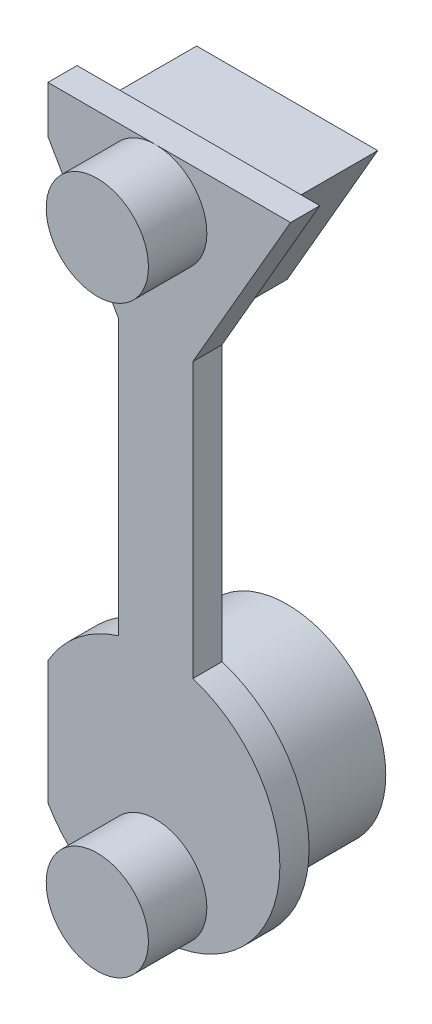
ISO-10303-21;
HEADER;
FILE_DESCRIPTION(('STEP AP214'),'2;1');
FILE_NAME('part.step','',(''),(''),'','','');
FILE_SCHEMA(('AUTOMOTIVE_DESIGN { 1 0 10303 214 1 1 1 1 }'));
ENDSEC;
DATA;
#1=APPLICATION_CONTEXT('core data for automotive mechanical design processes');
#2=APPLICATION_PROTOCOL_DEFINITION('international standard','automotive_design',2000,#1);
#3=PRODUCT_CONTEXT('',#1,'mechanical');
#4=PRODUCT('Part','Part','',(#3));
#5=PRODUCT_RELATED_PRODUCT_CATEGORY('part','',(#4));
#6=PRODUCT_DEFINITION_FORMATION('','',#4);
#7=PRODUCT_DEFINITION_CONTEXT('part definition',#1,'design');
#8=PRODUCT_DEFINITION('design','',#6,#7);
#9=PRODUCT_DEFINITION_SHAPE('','',#8);
#10=(LENGTH_UNIT() NAMED_UNIT(*) SI_UNIT(.MILLI.,.METRE.));
#11=(NAMED_UNIT(*) PLANE_ANGLE_UNIT() SI_UNIT($,.RADIAN.));
#12=(NAMED_UNIT(*) SI_UNIT($,.STERADIAN.) SOLID_ANGLE_UNIT());
#13=UNCERTAINTY_MEASURE_WITH_UNIT(LENGTH_MEASURE(1.E-05),#10,'distance_accuracy_value','');
#14=(GEOMETRIC_REPRESENTATION_CONTEXT(3) GLOBAL_UNCERTAINTY_ASSIGNED_CONTEXT((#13)) GLOBAL_UNIT_ASSIGNED_CONTEXT((#10,
#11,#12)) REPRESENTATION_CONTEXT('',''));
#15=CARTESIAN_POINT('',(0.,0.,0.));
#16=DIRECTION('',(0.,0.,1.));
#17=DIRECTION('',(1.,0.,0.));
#18=AXIS2_PLACEMENT_3D('',#15,#16,#17);
#19=CARTESIAN_POINT('',(0.126725060128514,-6.,0.8));
#20=DIRECTION('',(0.,0.,-1.));
#21=DIRECTION('',(-1.,0.,0.));
#22=AXIS2_PLACEMENT_3D('',#19,#20,#21);
#23=CYLINDRICAL_SURFACE('',#22,3.4);
#24=CARTESIAN_POINT('',(0.126725060128514,-6.,0.8));
#25=DIRECTION('',(0.,0.,1.));
#26=DIRECTION('',(1.,0.,0.));
#27=AXIS2_PLACEMENT_3D('',#24,#25,#26);
#28=CIRCLE('',#27,3.4);
#29=CARTESIAN_POINT('',(-2.82672506012852,-7.68437893217463,0.8));
#30=VERTEX_POINT('',#29);
#31=CARTESIAN_POINT('',(0.126725060128514,-9.4,0.8));
#32=VERTEX_POINT('',#31);
#33=EDGE_CURVE('E152',#30,#32,#28,.T.);
#34=ORIENTED_EDGE('',*,*,#33,.F.);
#35=DIRECTION('',(0.,0.,-1.));
#36=VECTOR('',#35,1.);
#37=CARTESIAN_POINT('',(-2.82672506012852,-7.68437893217463,0.8));
#38=LINE('',#37,#36);
#39=CARTESIAN_POINT('',(-2.82672506012852,-7.68437893217463,0.));
#40=VERTEX_POINT('',#39);
#41=EDGE_CURVE('E54',#30,#40,#38,.T.);
#42=ORIENTED_EDGE('',*,*,#41,.T.);
#43=CARTESIAN_POINT('',(0.126725060128514,-6.,0.));
#44=DIRECTION('',(0.,0.,1.));
#45=DIRECTION('',(1.,0.,0.));
#46=AXIS2_PLACEMENT_3D('',#43,#44,#45);
#47=CIRCLE('',#46,3.4);
#48=CARTESIAN_POINT('',(1.14270034624464,-2.75534374424635,0.));
#49=VERTEX_POINT('',#48);
#50=EDGE_CURVE('E162',#40,#49,#47,.T.);
#51=ORIENTED_EDGE('',*,*,#50,.T.);
#52=DIRECTION('',(0.,0.,-1.));
#53=VECTOR('',#52,1.);
#54=CARTESIAN_POINT('',(1.14270034624464,-2.75534374424635,0.8));
#55=LINE('',#54,#53);
#56=CARTESIAN_POINT('',(1.14270034624464,-2.75534374424635,0.8));
#57=VERTEX_POINT('',#56);
#58=EDGE_CURVE('E179',#57,#49,#55,.T.);
#59=ORIENTED_EDGE('',*,*,#58,.F.);
#60=EDGE_CURVE('E154',#32,#57,#28,.T.);
#61=ORIENTED_EDGE('',*,*,#60,.F.);
#62=EDGE_LOOP('',(#34,#42,#51,#59,#61));
#63=FACE_BOUND('',#62,.T.);
#64=ADVANCED_FACE('F39',(#63),#23,.T.);
#65=CARTESIAN_POINT('',(0.126725060128514,-6.,0.));
#66=DIRECTION('',(0.,0.,1.));
#67=DIRECTION('',(1.,0.,0.));
#68=AXIS2_PLACEMENT_3D('',#65,#66,#67);
#69=PLANE('',#68);
#70=ORIENTED_EDGE('',*,*,#50,.F.);
#71=DIRECTION('',(0.,1.,0.));
#72=VECTOR('',#71,1.);
#73=CARTESIAN_POINT('',(-2.82672506012852,11.8338217795605,0.));
#74=LINE('',#73,#72);
#75=CARTESIAN_POINT('',(-2.82672506012852,-4.31562106782537,0.));
#76=VERTEX_POINT('',#75);
#77=EDGE_CURVE('E257',#40,#76,#74,.T.);
#78=ORIENTED_EDGE('',*,*,#77,.T.);
#79=CARTESIAN_POINT('',(-0.88925022598761,-2.75534374424635,0.));
#80=VERTEX_POINT('',#79);
#81=EDGE_CURVE('E145',#80,#76,#47,.T.);
#82=ORIENTED_EDGE('',*,*,#81,.F.);
#83=DIRECTION('',(0.,1.,0.));
#84=VECTOR('',#83,1.);
#85=CARTESIAN_POINT('',(-0.889250225987609,4.76356839208082,0.));
#86=LINE('',#85,#84);
#87=CARTESIAN_POINT('',(-0.889250225987609,4.76356839208082,0.));
#88=VERTEX_POINT('',#87);
#89=EDGE_CURVE('E176',#80,#88,#86,.T.);
#90=ORIENTED_EDGE('',*,*,#89,.T.);
#91=DIRECTION('',(0.5,-0.866025403784438,0.));
#92=VECTOR('',#91,1.);
#93=CARTESIAN_POINT('',(0.126725060128516,3.00384757729336,0.));
#94=LINE('',#93,#92);
#95=CARTESIAN_POINT('',(-2.82672506012852,8.11937324319896,0.));
#96=VERTEX_POINT('',#95);
#97=EDGE_CURVE('E190',#96,#88,#94,.T.);
#98=ORIENTED_EDGE('',*,*,#97,.F.);
#99=CARTESIAN_POINT('',(-2.82672506012852,9.4,0.));
#100=VERTEX_POINT('',#99);
#101=EDGE_CURVE('E138',#96,#100,#74,.T.);
#102=ORIENTED_EDGE('',*,*,#101,.T.);
#103=DIRECTION('',(-1.,0.,0.));
#104=VECTOR('',#103,1.);
#105=CARTESIAN_POINT('',(-3.56609526289904,9.4,0.));
#106=LINE('',#105,#104);
#107=CARTESIAN_POINT('',(3.81954538315607,9.4,0.));
#108=VERTEX_POINT('',#107);
#109=EDGE_CURVE('E199',#108,#100,#106,.T.);
#110=ORIENTED_EDGE('',*,*,#109,.F.);
#111=DIRECTION('',(0.5,0.866025403784439,0.));
#112=VECTOR('',#111,1.);
#113=CARTESIAN_POINT('',(3.81954538315607,9.4,0.));
#114=LINE('',#113,#112);
#115=CARTESIAN_POINT('',(1.14270034624464,4.76356839208082,0.));
#116=VERTEX_POINT('',#115);
#117=EDGE_CURVE('E193',#116,#108,#114,.T.);
#118=ORIENTED_EDGE('',*,*,#117,.F.);
#119=DIRECTION('',(0.,-1.,0.));
#120=VECTOR('',#119,1.);
#121=CARTESIAN_POINT('',(1.14270034624464,4.76356839208082,0.));
#122=LINE('',#121,#120);
#123=EDGE_CURVE('E189',#116,#49,#122,.T.);
#124=ORIENTED_EDGE('',*,*,#123,.T.);
#125=EDGE_LOOP('',(#70,#78,#82,#90,#98,#102,#110,#118,#124));
#126=FACE_BOUND('',#125,.T.);
#127=CARTESIAN_POINT('',(0.126725060128514,-6.,0.));
#128=DIRECTION('',(0.,0.,1.));
#129=DIRECTION('',(1.,0.,0.));
#130=AXIS2_PLACEMENT_3D('',#127,#128,#129);
#131=CIRCLE('',#130,2.7);
#132=CARTESIAN_POINT('',(2.82672506012852,-6.,0.));
#133=VERTEX_POINT('',#132);
#134=EDGE_CURVE('E47',#133,#133,#131,.F.);
#135=ORIENTED_EDGE('',*,*,#134,.F.);
#136=EDGE_LOOP('',(#135));
#137=FACE_BOUND('',#136,.T.);
#138=DIRECTION('',(-0.5,-0.866025403784439,0.));
#139=VECTOR('',#138,1.);
#140=CARTESIAN_POINT('',(0.126725060128514,4.40384757729337,0.));
#141=LINE('',#140,#139);
#142=CARTESIAN_POINT('',(2.60710981785785,8.7,0.));
#143=VERTEX_POINT('',#142);
#144=CARTESIAN_POINT('',(0.126725060128514,4.40384757729337,0.));
#145=VERTEX_POINT('',#144);
#146=EDGE_CURVE('E219',#143,#145,#141,.T.);
#147=ORIENTED_EDGE('',*,*,#146,.F.);
#148=DIRECTION('',(1.,0.,0.));
#149=VECTOR('',#148,1.);
#150=CARTESIAN_POINT('',(2.60710981785785,8.7,0.));
#151=LINE('',#150,#149);
#152=CARTESIAN_POINT('',(-2.35365969760082,8.7,0.));
#153=VERTEX_POINT('',#152);
#154=EDGE_CURVE('E223',#153,#143,#151,.T.);
#155=ORIENTED_EDGE('',*,*,#154,.F.);
#156=DIRECTION('',(-0.5,0.866025403784439,0.));
#157=VECTOR('',#156,1.);
#158=CARTESIAN_POINT('',(-2.35365969760082,8.7,0.));
#159=LINE('',#158,#157);
#160=EDGE_CURVE('E231',#145,#153,#159,.T.);
#161=ORIENTED_EDGE('',*,*,#160,.F.);
#162=EDGE_LOOP('',(#147,#155,#161));
#163=FACE_BOUND('',#162,.T.);
#164=ADVANCED_FACE('F260',(#126,#137,#163),#69,.F.);
#165=ORIENTED_EDGE('',*,*,#81,.T.);
#166=DIRECTION('',(0.,0.,-1.));
#167=VECTOR('',#166,1.);
#168=CARTESIAN_POINT('',(-2.82672506012852,-4.31562106782537,0.8));
#169=LINE('',#168,#167);
#170=CARTESIAN_POINT('',(-2.82672506012852,-4.31562106782537,0.8));
#171=VERTEX_POINT('',#170);
#172=EDGE_CURVE('E133',#76,#171,#169,.F.);
#173=ORIENTED_EDGE('',*,*,#172,.T.);
#174=CARTESIAN_POINT('',(-0.88925022598761,-2.75534374424635,0.8));
#175=VERTEX_POINT('',#174);
#176=EDGE_CURVE('E143',#175,#171,#28,.T.);
#177=ORIENTED_EDGE('',*,*,#176,.F.);
#178=DIRECTION('',(0.,0.,-1.));
#179=VECTOR('',#178,1.);
#180=CARTESIAN_POINT('',(-0.88925022598761,-2.75534374424635,0.8));
#181=LINE('',#180,#179);
#182=EDGE_CURVE('E173',#175,#80,#181,.T.);
#183=ORIENTED_EDGE('',*,*,#182,.T.);
#184=EDGE_LOOP('',(#165,#173,#177,#183));
#185=FACE_BOUND('',#184,.T.);
#186=ADVANCED_FACE('F41',(#185),#23,.T.);
#187=CARTESIAN_POINT('',(0.126725060128514,-6.,0.8));
#188=DIRECTION('',(0.,0.,1.));
#189=DIRECTION('',(1.,0.,0.));
#190=AXIS2_PLACEMENT_3D('',#187,#188,#189);
#191=PLANE('',#190);
#192=DIRECTION('',(0.,1.,0.));
#193=VECTOR('',#192,1.);
#194=CARTESIAN_POINT('',(-2.82672506012852,11.8338217795605,0.8));
#195=LINE('',#194,#193);
#196=EDGE_CURVE('E130',#30,#171,#195,.T.);
#197=ORIENTED_EDGE('',*,*,#196,.F.);
#198=ORIENTED_EDGE('',*,*,#33,.T.);
#199=CARTESIAN_POINT('',(0.126725060128514,-8.,0.8));
#200=DIRECTION('',(0.,0.,1.));
#201=DIRECTION('',(1.,0.,0.));
#202=AXIS2_PLACEMENT_3D('',#199,#200,#201);
#203=CIRCLE('',#202,1.4);
#204=EDGE_CURVE('E248',#32,#32,#203,.T.);
#205=ORIENTED_EDGE('',*,*,#204,.F.);
#206=ORIENTED_EDGE('',*,*,#60,.T.);
#207=DIRECTION('',(0.,-1.,0.));
#208=VECTOR('',#207,1.);
#209=CARTESIAN_POINT('',(1.14270034624464,4.76356839208082,0.8));
#210=LINE('',#209,#208);
#211=CARTESIAN_POINT('',(1.14270034624464,4.76356839208082,0.8));
#212=VERTEX_POINT('',#211);
#213=EDGE_CURVE('E184',#212,#57,#210,.T.);
#214=ORIENTED_EDGE('',*,*,#213,.F.);
#215=DIRECTION('',(0.5,0.866025403784439,0.));
#216=VECTOR('',#215,1.);
#217=CARTESIAN_POINT('',(3.81954538315607,9.4,0.8));
#218=LINE('',#217,#216);
#219=CARTESIAN_POINT('',(3.81954538315607,9.4,0.8));
#220=VERTEX_POINT('',#219);
#221=EDGE_CURVE('E205',#212,#220,#218,.T.);
#222=ORIENTED_EDGE('',*,*,#221,.T.);
#223=DIRECTION('',(-1.,0.,0.));
#224=VECTOR('',#223,1.);
#225=CARTESIAN_POINT('',(-3.56609526289904,9.4,0.8));
#226=LINE('',#225,#224);
#227=CARTESIAN_POINT('',(0.126725060128514,9.4,0.8));
#228=VERTEX_POINT('',#227);
#229=EDGE_CURVE('E203',#220,#228,#226,.T.);
#230=ORIENTED_EDGE('',*,*,#229,.T.);
#231=CARTESIAN_POINT('',(0.126725060128514,8.,0.8));
#232=DIRECTION('',(0.,0.,1.));
#233=DIRECTION('',(1.,0.,0.));
#234=AXIS2_PLACEMENT_3D('',#231,#232,#233);
#235=CIRCLE('',#234,1.4);
#236=EDGE_CURVE('E245',#228,#228,#235,.T.);
#237=ORIENTED_EDGE('',*,*,#236,.F.);
#238=CARTESIAN_POINT('',(-2.82672506012852,9.4,0.8));
#239=VERTEX_POINT('',#238);
#240=EDGE_CURVE('E206',#228,#239,#226,.T.);
#241=ORIENTED_EDGE('',*,*,#240,.T.);
#242=CARTESIAN_POINT('',(-2.82672506012852,8.11937324319896,0.8));
#243=VERTEX_POINT('',#242);
#244=EDGE_CURVE('E62',#243,#239,#195,.T.);
#245=ORIENTED_EDGE('',*,*,#244,.F.);
#246=DIRECTION('',(0.5,-0.866025403784438,0.));
#247=VECTOR('',#246,1.);
#248=CARTESIAN_POINT('',(0.126725060128516,3.00384757729336,0.8));
#249=LINE('',#248,#247);
#250=CARTESIAN_POINT('',(-0.889250225987609,4.76356839208082,0.8));
#251=VERTEX_POINT('',#250);
#252=EDGE_CURVE('E207',#243,#251,#249,.T.);
#253=ORIENTED_EDGE('',*,*,#252,.T.);
#254=DIRECTION('',(0.,1.,0.));
#255=VECTOR('',#254,1.);
#256=CARTESIAN_POINT('',(-0.889250225987609,4.76356839208082,0.8));
#257=LINE('',#256,#255);
#258=EDGE_CURVE('E151',#175,#251,#257,.T.);
#259=ORIENTED_EDGE('',*,*,#258,.F.);
#260=ORIENTED_EDGE('',*,*,#176,.T.);
#261=EDGE_LOOP('',(#197,#198,#205,#206,#214,#222,#230,#237,#241,#245,#253,#259,#260));
#262=FACE_BOUND('',#261,.T.);
#263=ADVANCED_FACE('F149',(#262),#191,.T.);
#264=CARTESIAN_POINT('',(1.14270034624464,4.76356839208082,0.8));
#265=DIRECTION('',(1.,0.,0.));
#266=DIRECTION('',(0.,1.,0.));
#267=AXIS2_PLACEMENT_3D('',#264,#265,#266);
#268=PLANE('',#267);
#269=ORIENTED_EDGE('',*,*,#123,.F.);
#270=DIRECTION('',(0.,0.,-1.));
#271=VECTOR('',#270,1.);
#272=CARTESIAN_POINT('',(1.14270034624464,4.76356839208082,0.8));
#273=LINE('',#272,#271);
#274=EDGE_CURVE('E163',#212,#116,#273,.T.);
#275=ORIENTED_EDGE('',*,*,#274,.F.);
#276=ORIENTED_EDGE('',*,*,#213,.T.);
#277=ORIENTED_EDGE('',*,*,#58,.T.);
#278=EDGE_LOOP('',(#269,#275,#276,#277));
#279=FACE_BOUND('',#278,.T.);
#280=ADVANCED_FACE('F289',(#279),#268,.T.);
#281=CARTESIAN_POINT('',(-0.889250225987609,4.76356839208082,0.8));
#282=DIRECTION('',(-1.,0.,0.));
#283=DIRECTION('',(0.,-1.,0.));
#284=AXIS2_PLACEMENT_3D('',#281,#282,#283);
#285=PLANE('',#284);
#286=ORIENTED_EDGE('',*,*,#89,.F.);
#287=ORIENTED_EDGE('',*,*,#182,.F.);
#288=ORIENTED_EDGE('',*,*,#258,.T.);
#289=DIRECTION('',(0.,0.,-1.));
#290=VECTOR('',#289,1.);
#291=CARTESIAN_POINT('',(-0.889250225987609,4.76356839208082,0.8));
#292=LINE('',#291,#290);
#293=EDGE_CURVE('E167',#251,#88,#292,.T.);
#294=ORIENTED_EDGE('',*,*,#293,.T.);
#295=EDGE_LOOP('',(#286,#287,#288,#294));
#296=FACE_BOUND('',#295,.T.);
#297=ADVANCED_FACE('F294',(#296),#285,.T.);
#298=CARTESIAN_POINT('',(0.126725060128516,3.00384757729336,0.8));
#299=DIRECTION('',(0.866025403784438,0.5,0.));
#300=DIRECTION('',(-0.5,0.866025403784439,0.));
#301=AXIS2_PLACEMENT_3D('',#298,#299,#300);
#302=PLANE('',#301);
#303=ORIENTED_EDGE('',*,*,#252,.F.);
#304=DIRECTION('',(0.,0.,-1.));
#305=VECTOR('',#304,1.);
#306=CARTESIAN_POINT('',(-2.82672506012852,8.11937324319895,0.8));
#307=LINE('',#306,#305);
#308=EDGE_CURVE('E146',#243,#96,#307,.T.);
#309=ORIENTED_EDGE('',*,*,#308,.T.);
#310=ORIENTED_EDGE('',*,*,#97,.T.);
#311=ORIENTED_EDGE('',*,*,#293,.F.);
#312=EDGE_LOOP('',(#303,#309,#310,#311));
#313=FACE_BOUND('',#312,.T.);
#314=ADVANCED_FACE('F299',(#313),#302,.F.);
#315=CARTESIAN_POINT('',(3.81954538315607,9.4,0.8));
#316=DIRECTION('',(-0.866025403784439,0.5,0.));
#317=DIRECTION('',(-0.5,-0.866025403784439,0.));
#318=AXIS2_PLACEMENT_3D('',#315,#316,#317);
#319=PLANE('',#318);
#320=ORIENTED_EDGE('',*,*,#274,.T.);
#321=ORIENTED_EDGE('',*,*,#117,.T.);
#322=DIRECTION('',(0.,0.,-1.));
#323=VECTOR('',#322,1.);
#324=CARTESIAN_POINT('',(3.81954538315607,9.4,0.8));
#325=LINE('',#324,#323);
#326=EDGE_CURVE('E214',#220,#108,#325,.T.);
#327=ORIENTED_EDGE('',*,*,#326,.F.);
#328=ORIENTED_EDGE('',*,*,#221,.F.);
#329=EDGE_LOOP('',(#320,#321,#327,#328));
#330=FACE_BOUND('',#329,.T.);
#331=ADVANCED_FACE('F304',(#330),#319,.F.);
#332=CARTESIAN_POINT('',(-3.56609526289904,9.4,0.8));
#333=DIRECTION('',(0.,-1.,0.));
#334=DIRECTION('',(1.,0.,0.));
#335=AXIS2_PLACEMENT_3D('',#332,#333,#334);
#336=PLANE('',#335);
#337=ORIENTED_EDGE('',*,*,#109,.T.);
#338=DIRECTION('',(0.,0.,1.));
#339=VECTOR('',#338,1.);
#340=CARTESIAN_POINT('',(-2.82672506012852,9.4,0.8));
#341=LINE('',#340,#339);
#342=EDGE_CURVE('E11',#100,#239,#341,.T.);
#343=ORIENTED_EDGE('',*,*,#342,.T.);
#344=ORIENTED_EDGE('',*,*,#240,.F.);
#345=ORIENTED_EDGE('',*,*,#229,.F.);
#346=ORIENTED_EDGE('',*,*,#326,.T.);
#347=EDGE_LOOP('',(#337,#343,#344,#345,#346));
#348=FACE_BOUND('',#347,.T.);
#349=ADVANCED_FACE('F300',(#348),#336,.F.);
#350=CARTESIAN_POINT('',(0.126725060128514,-6.,-2.8));
#351=DIRECTION('',(0.,0.,1.));
#352=DIRECTION('',(1.,0.,0.));
#353=AXIS2_PLACEMENT_3D('',#350,#351,#352);
#354=CYLINDRICAL_SURFACE('',#353,2.7);
#355=CARTESIAN_POINT('',(0.126725060128514,-6.,-2.8));
#356=DIRECTION('',(0.,0.,-1.));
#357=DIRECTION('',(-1.,0.,0.));
#358=AXIS2_PLACEMENT_3D('',#355,#356,#357);
#359=CIRCLE('',#358,2.7);
#360=CARTESIAN_POINT('',(-2.57327493987149,-6.,-2.8));
#361=VERTEX_POINT('',#360);
#362=EDGE_CURVE('E216',#361,#361,#359,.T.);
#363=ORIENTED_EDGE('',*,*,#362,.F.);
#364=EDGE_LOOP('',(#363));
#365=FACE_BOUND('',#364,.T.);
#366=ORIENTED_EDGE('',*,*,#134,.T.);
#367=EDGE_LOOP('',(#366));
#368=FACE_BOUND('',#367,.T.);
#369=ADVANCED_FACE('F303',(#365,#368),#354,.T.);
#370=CARTESIAN_POINT('',(0.126725060128514,-6.,-2.8));
#371=DIRECTION('',(0.,0.,-1.));
#372=DIRECTION('',(-1.,0.,0.));
#373=AXIS2_PLACEMENT_3D('',#370,#371,#372);
#374=PLANE('',#373);
#375=ORIENTED_EDGE('',*,*,#362,.T.);
#376=EDGE_LOOP('',(#375));
#377=FACE_BOUND('',#376,.T.);
#378=ADVANCED_FACE('F311',(#377),#374,.T.);
#379=CARTESIAN_POINT('',(0.126725060128514,4.40384757729337,-2.8));
#380=DIRECTION('',(-0.866025403784439,0.5,0.));
#381=DIRECTION('',(-0.5,-0.866025403784439,0.));
#382=AXIS2_PLACEMENT_3D('',#379,#380,#381);
#383=PLANE('',#382);
#384=ORIENTED_EDGE('',*,*,#146,.T.);
#385=DIRECTION('',(0.,0.,1.));
#386=VECTOR('',#385,1.);
#387=CARTESIAN_POINT('',(0.126725060128514,4.40384757729337,-2.8));
#388=LINE('',#387,#386);
#389=CARTESIAN_POINT('',(0.126725060128514,4.40384757729337,-2.8));
#390=VERTEX_POINT('',#389);
#391=EDGE_CURVE('E241',#390,#145,#388,.T.);
#392=ORIENTED_EDGE('',*,*,#391,.F.);
#393=DIRECTION('',(-0.5,-0.866025403784439,0.));
#394=VECTOR('',#393,1.);
#395=CARTESIAN_POINT('',(0.126725060128514,4.40384757729337,-2.8));
#396=LINE('',#395,#394);
#397=CARTESIAN_POINT('',(2.60710981785785,8.7,-2.8));
#398=VERTEX_POINT('',#397);
#399=EDGE_CURVE('E220',#398,#390,#396,.T.);
#400=ORIENTED_EDGE('',*,*,#399,.F.);
#401=DIRECTION('',(0.,0.,1.));
#402=VECTOR('',#401,1.);
#403=CARTESIAN_POINT('',(2.60710981785785,8.7,-2.8));
#404=LINE('',#403,#402);
#405=EDGE_CURVE('E228',#398,#143,#404,.T.);
#406=ORIENTED_EDGE('',*,*,#405,.T.);
#407=EDGE_LOOP('',(#384,#392,#400,#406));
#408=FACE_BOUND('',#407,.T.);
#409=ADVANCED_FACE('F315',(#408),#383,.F.);
#410=CARTESIAN_POINT('',(-2.35365969760082,8.7,-2.8));
#411=DIRECTION('',(0.866025403784439,0.5,0.));
#412=DIRECTION('',(-0.5,0.866025403784439,0.));
#413=AXIS2_PLACEMENT_3D('',#410,#411,#412);
#414=PLANE('',#413);
#415=ORIENTED_EDGE('',*,*,#160,.T.);
#416=DIRECTION('',(0.,0.,1.));
#417=VECTOR('',#416,1.);
#418=CARTESIAN_POINT('',(-2.35365969760082,8.7,-2.8));
#419=LINE('',#418,#417);
#420=CARTESIAN_POINT('',(-2.35365969760082,8.7,-2.8));
#421=VERTEX_POINT('',#420);
#422=EDGE_CURVE('E238',#421,#153,#419,.T.);
#423=ORIENTED_EDGE('',*,*,#422,.F.);
#424=DIRECTION('',(-0.5,0.866025403784439,0.));
#425=VECTOR('',#424,1.);
#426=CARTESIAN_POINT('',(-2.35365969760082,8.7,-2.8));
#427=LINE('',#426,#425);
#428=EDGE_CURVE('E224',#390,#421,#427,.T.);
#429=ORIENTED_EDGE('',*,*,#428,.F.);
#430=ORIENTED_EDGE('',*,*,#391,.T.);
#431=EDGE_LOOP('',(#415,#423,#429,#430));
#432=FACE_BOUND('',#431,.T.);
#433=ADVANCED_FACE('F324',(#432),#414,.F.);
#434=CARTESIAN_POINT('',(2.60710981785785,8.7,-2.8));
#435=DIRECTION('',(0.,-1.,0.));
#436=DIRECTION('',(0.,0.,-1.));
#437=AXIS2_PLACEMENT_3D('',#434,#435,#436);
#438=PLANE('',#437);
#439=ORIENTED_EDGE('',*,*,#154,.T.);
#440=ORIENTED_EDGE('',*,*,#405,.F.);
#441=DIRECTION('',(1.,0.,0.));
#442=VECTOR('',#441,1.);
#443=CARTESIAN_POINT('',(2.60710981785785,8.7,-2.8));
#444=LINE('',#443,#442);
#445=EDGE_CURVE('E226',#421,#398,#444,.T.);
#446=ORIENTED_EDGE('',*,*,#445,.F.);
#447=ORIENTED_EDGE('',*,*,#422,.T.);
#448=EDGE_LOOP('',(#439,#440,#446,#447));
#449=FACE_BOUND('',#448,.T.);
#450=ADVANCED_FACE('F320',(#449),#438,.F.);
#451=CARTESIAN_POINT('',(0.,0.,-2.8));
#452=DIRECTION('',(0.,0.,1.));
#453=DIRECTION('',(1.,0.,0.));
#454=AXIS2_PLACEMENT_3D('',#451,#452,#453);
#455=PLANE('',#454);
#456=ORIENTED_EDGE('',*,*,#399,.T.);
#457=ORIENTED_EDGE('',*,*,#428,.T.);
#458=ORIENTED_EDGE('',*,*,#445,.T.);
#459=EDGE_LOOP('',(#456,#457,#458));
#460=FACE_BOUND('',#459,.T.);
#461=ADVANCED_FACE('F317',(#460),#455,.F.);
#462=CARTESIAN_POINT('',(0.126725060128514,8.,2.4));
#463=DIRECTION('',(0.,0.,-1.));
#464=DIRECTION('',(-1.,0.,0.));
#465=AXIS2_PLACEMENT_3D('',#462,#463,#464);
#466=CYLINDRICAL_SURFACE('',#465,1.4);
#467=CARTESIAN_POINT('',(0.126725060128514,8.,2.4));
#468=DIRECTION('',(0.,0.,1.));
#469=DIRECTION('',(1.,0.,0.));
#470=AXIS2_PLACEMENT_3D('',#467,#468,#469);
#471=CIRCLE('',#470,1.4);
#472=CARTESIAN_POINT('',(1.52672506012851,8.,2.4));
#473=VERTEX_POINT('',#472);
#474=EDGE_CURVE('E244',#473,#473,#471,.T.);
#475=ORIENTED_EDGE('',*,*,#474,.F.);
#476=EDGE_LOOP('',(#475));
#477=FACE_BOUND('',#476,.T.);
#478=ORIENTED_EDGE('',*,*,#236,.T.);
#479=EDGE_LOOP('',(#478));
#480=FACE_BOUND('',#479,.T.);
#481=ADVANCED_FACE('F276',(#477,#480),#466,.T.);
#482=CARTESIAN_POINT('',(0.126725060128514,8.,2.4));
#483=DIRECTION('',(0.,0.,1.));
#484=DIRECTION('',(1.,0.,0.));
#485=AXIS2_PLACEMENT_3D('',#482,#483,#484);
#486=PLANE('',#485);
#487=ORIENTED_EDGE('',*,*,#474,.T.);
#488=EDGE_LOOP('',(#487));
#489=FACE_BOUND('',#488,.T.);
#490=ADVANCED_FACE('F266',(#489),#486,.T.);
#491=CARTESIAN_POINT('',(0.126725060128514,-8.,2.4));
#492=DIRECTION('',(0.,0.,-1.));
#493=DIRECTION('',(-1.,0.,0.));
#494=AXIS2_PLACEMENT_3D('',#491,#492,#493);
#495=CYLINDRICAL_SURFACE('',#494,1.4);
#496=CARTESIAN_POINT('',(0.126725060128514,-8.,2.4));
#497=DIRECTION('',(0.,0.,1.));
#498=DIRECTION('',(1.,0.,0.));
#499=AXIS2_PLACEMENT_3D('',#496,#497,#498);
#500=CIRCLE('',#499,1.4);
#501=CARTESIAN_POINT('',(1.52672506012852,-8.,2.4));
#502=VERTEX_POINT('',#501);
#503=EDGE_CURVE('E251',#502,#502,#500,.T.);
#504=ORIENTED_EDGE('',*,*,#503,.F.);
#505=EDGE_LOOP('',(#504));
#506=FACE_BOUND('',#505,.T.);
#507=ORIENTED_EDGE('',*,*,#204,.T.);
#508=EDGE_LOOP('',(#507));
#509=FACE_BOUND('',#508,.T.);
#510=ADVANCED_FACE('F263',(#506,#509),#495,.T.);
#511=CARTESIAN_POINT('',(0.126725060128514,-8.,2.4));
#512=DIRECTION('',(0.,0.,1.));
#513=DIRECTION('',(1.,0.,0.));
#514=AXIS2_PLACEMENT_3D('',#511,#512,#513);
#515=PLANE('',#514);
#516=ORIENTED_EDGE('',*,*,#503,.T.);
#517=EDGE_LOOP('',(#516));
#518=FACE_BOUND('',#517,.T.);
#519=ADVANCED_FACE('F265',(#518),#515,.T.);
#520=CARTESIAN_POINT('',(-2.82672506012852,11.8338217795605,0.));
#521=DIRECTION('',(1.,0.,0.));
#522=DIRECTION('',(0.,1.,0.));
#523=AXIS2_PLACEMENT_3D('',#520,#521,#522);
#524=PLANE('',#523);
#525=ORIENTED_EDGE('',*,*,#244,.T.);
#526=ORIENTED_EDGE('',*,*,#342,.F.);
#527=ORIENTED_EDGE('',*,*,#101,.F.);
#528=ORIENTED_EDGE('',*,*,#308,.F.);
#529=EDGE_LOOP('',(#525,#526,#527,#528));
#530=FACE_BOUND('',#529,.T.);
#531=ADVANCED_FACE('F273',(#530),#524,.F.);
#532=ORIENTED_EDGE('',*,*,#196,.T.);
#533=ORIENTED_EDGE('',*,*,#172,.F.);
#534=ORIENTED_EDGE('',*,*,#77,.F.);
#535=ORIENTED_EDGE('',*,*,#41,.F.);
#536=EDGE_LOOP('',(#532,#533,#534,#535));
#537=FACE_BOUND('',#536,.T.);
#538=ADVANCED_FACE('F132',(#537),#524,.F.);
#539=CLOSED_SHELL('',(#64,#164,#186,#263,#280,#297,#314,#331,#349,#369,#378,#409,#433,#450,#461,
#481,#490,#510,#519,#531,#538));
#540=MANIFOLD_SOLID_BREP('B2',#539);
#541=ADVANCED_BREP_SHAPE_REPRESENTATION('',(#18,#540),#14);
#542=SHAPE_DEFINITION_REPRESENTATION(#9,#541);
ENDSEC;
END-ISO-10303-21;
